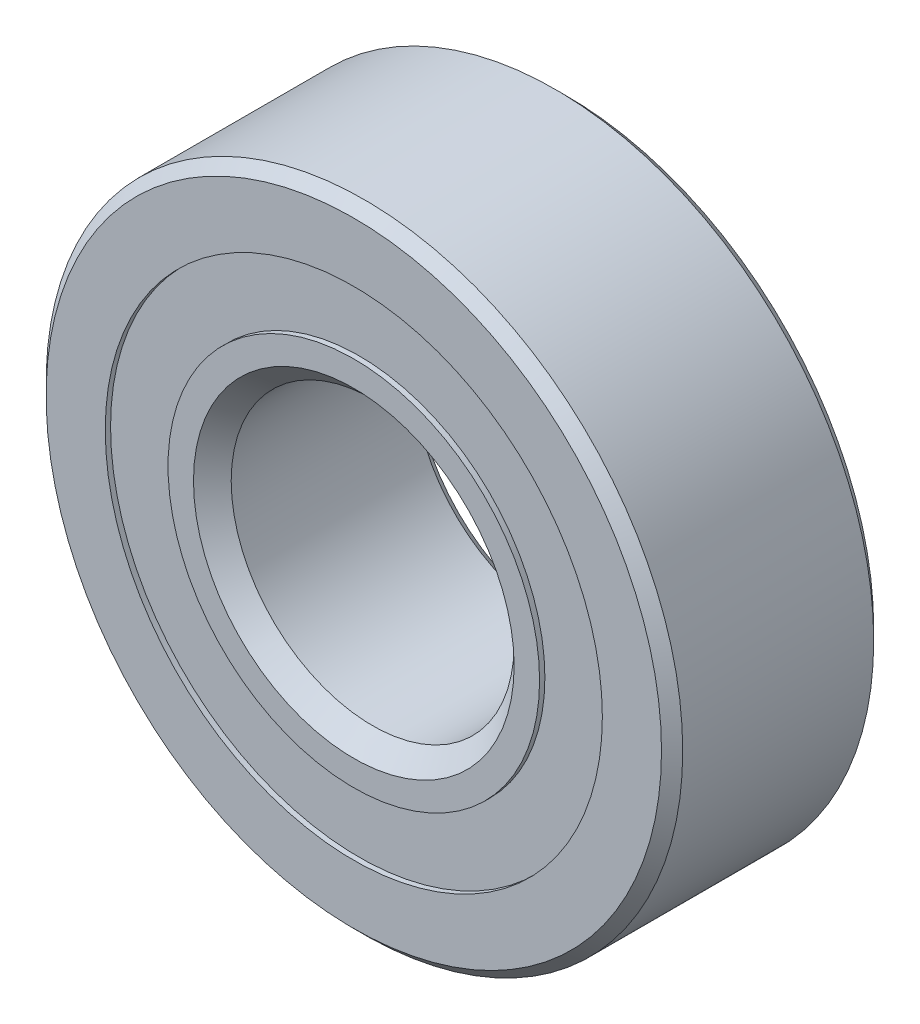
ISO-10303-21;
HEADER;
FILE_DESCRIPTION(('STEP AP214'),'2;1');
FILE_NAME('part.step','',(''),(''),'','','');
FILE_SCHEMA(('AUTOMOTIVE_DESIGN { 1 0 10303 214 1 1 1 1 }'));
ENDSEC;
DATA;
#1=APPLICATION_CONTEXT('core data for automotive mechanical design processes');
#2=APPLICATION_PROTOCOL_DEFINITION('international standard','automotive_design',2000,#1);
#3=PRODUCT_CONTEXT('',#1,'mechanical');
#4=PRODUCT('Part','Part','',(#3));
#5=PRODUCT_RELATED_PRODUCT_CATEGORY('part','',(#4));
#6=PRODUCT_DEFINITION_FORMATION('','',#4);
#7=PRODUCT_DEFINITION_CONTEXT('part definition',#1,'design');
#8=PRODUCT_DEFINITION('design','',#6,#7);
#9=PRODUCT_DEFINITION_SHAPE('','',#8);
#10=(LENGTH_UNIT() NAMED_UNIT(*) SI_UNIT(.MILLI.,.METRE.));
#11=(NAMED_UNIT(*) PLANE_ANGLE_UNIT() SI_UNIT($,.RADIAN.));
#12=(NAMED_UNIT(*) SI_UNIT($,.STERADIAN.) SOLID_ANGLE_UNIT());
#13=UNCERTAINTY_MEASURE_WITH_UNIT(LENGTH_MEASURE(1.E-05),#10,'distance_accuracy_value','');
#14=(GEOMETRIC_REPRESENTATION_CONTEXT(3) GLOBAL_UNCERTAINTY_ASSIGNED_CONTEXT((#13)) GLOBAL_UNIT_ASSIGNED_CONTEXT((#10,
#11,#12)) REPRESENTATION_CONTEXT('',''));
#15=CARTESIAN_POINT('',(0.,0.,0.));
#16=DIRECTION('',(0.,0.,1.));
#17=DIRECTION('',(1.,0.,0.));
#18=AXIS2_PLACEMENT_3D('',#15,#16,#17);
#19=CARTESIAN_POINT('',(0.,11.1561126373626,-4.524375));
#20=DIRECTION('',(0.,0.,1.));
#21=DIRECTION('',(1.,0.,0.));
#22=AXIS2_PLACEMENT_3D('',#19,#20,#21);
#23=PLANE('',#22);
#24=CARTESIAN_POINT('',(0.,0.,-4.524375));
#25=DIRECTION('',(0.,0.,1.));
#26=DIRECTION('',(1.,0.,0.));
#27=AXIS2_PLACEMENT_3D('',#24,#25,#26);
#28=CIRCLE('',#27,11.1561126373626);
#29=CARTESIAN_POINT('',(11.1561126373626,0.,-4.524375));
#30=VERTEX_POINT('',#29);
#31=EDGE_CURVE('E55',#30,#30,#28,.T.);
#32=ORIENTED_EDGE('',*,*,#31,.F.);
#33=EDGE_LOOP('',(#32));
#34=FACE_BOUND('',#33,.T.);
#35=CARTESIAN_POINT('',(0.,0.,-4.524375));
#36=DIRECTION('',(0.,0.,1.));
#37=DIRECTION('',(1.,0.,0.));
#38=AXIS2_PLACEMENT_3D('',#35,#36,#37);
#39=CIRCLE('',#38,8.33881099868363);
#40=CARTESIAN_POINT('',(8.33881099868363,0.,-4.524375));
#41=VERTEX_POINT('',#40);
#42=EDGE_CURVE('E11',#41,#41,#39,.T.);
#43=ORIENTED_EDGE('',*,*,#42,.T.);
#44=EDGE_LOOP('',(#43));
#45=FACE_BOUND('',#44,.T.);
#46=ADVANCED_FACE('F41',(#34,#45),#23,.F.);
#47=CARTESIAN_POINT('',(0.,0.,4.7625));
#48=DIRECTION('',(0.,0.,1.));
#49=DIRECTION('',(1.,0.,0.));
#50=AXIS2_PLACEMENT_3D('',#47,#48,#49);
#51=CYLINDRICAL_SURFACE('',#50,8.33881099868363);
#52=ORIENTED_EDGE('',*,*,#42,.F.);
#53=EDGE_LOOP('',(#52));
#54=FACE_BOUND('',#53,.T.);
#55=CARTESIAN_POINT('',(0.,0.,-2.27628073054021));
#56=DIRECTION('',(0.,0.,1.));
#57=DIRECTION('',(1.,0.,0.));
#58=AXIS2_PLACEMENT_3D('',#55,#56,#57);
#59=CIRCLE('',#58,8.33881099868363);
#60=CARTESIAN_POINT('',(8.33881099868363,0.,-2.27628073054021));
#61=VERTEX_POINT('',#60);
#62=EDGE_CURVE('E47',#61,#61,#59,.T.);
#63=ORIENTED_EDGE('',*,*,#62,.T.);
#64=EDGE_LOOP('',(#63));
#65=FACE_BOUND('',#64,.T.);
#66=ADVANCED_FACE('F64',(#54,#65),#51,.F.);
#67=CARTESIAN_POINT('',(0.,11.1561126373626,-2.27628073054021));
#68=DIRECTION('',(0.,0.,-1.));
#69=DIRECTION('',(-1.,0.,0.));
#70=AXIS2_PLACEMENT_3D('',#67,#68,#69);
#71=PLANE('',#70);
#72=ORIENTED_EDGE('',*,*,#62,.F.);
#73=EDGE_LOOP('',(#72));
#74=FACE_BOUND('',#73,.T.);
#75=CARTESIAN_POINT('',(0.,0.,-2.27628073054021));
#76=DIRECTION('',(0.,0.,1.));
#77=DIRECTION('',(1.,0.,0.));
#78=AXIS2_PLACEMENT_3D('',#75,#76,#77);
#79=CIRCLE('',#78,11.1561126373626);
#80=CARTESIAN_POINT('',(11.1561126373626,0.,-2.27628073054021));
#81=VERTEX_POINT('',#80);
#82=EDGE_CURVE('E51',#81,#81,#79,.T.);
#83=ORIENTED_EDGE('',*,*,#82,.T.);
#84=EDGE_LOOP('',(#83));
#85=FACE_BOUND('',#84,.T.);
#86=ADVANCED_FACE('F68',(#74,#85),#71,.F.);
#87=CARTESIAN_POINT('',(0.,0.,4.7625));
#88=DIRECTION('',(0.,0.,1.));
#89=DIRECTION('',(1.,0.,0.));
#90=AXIS2_PLACEMENT_3D('',#87,#88,#89);
#91=CYLINDRICAL_SURFACE('',#90,11.1561126373626);
#92=ORIENTED_EDGE('',*,*,#82,.F.);
#93=EDGE_LOOP('',(#92));
#94=FACE_BOUND('',#93,.T.);
#95=ORIENTED_EDGE('',*,*,#31,.T.);
#96=EDGE_LOOP('',(#95));
#97=FACE_BOUND('',#96,.T.);
#98=ADVANCED_FACE('F61',(#94,#97),#91,.T.);
#99=CLOSED_SHELL('',(#46,#66,#86,#98));
#100=MANIFOLD_SOLID_BREP('B2',#99);
#101=CARTESIAN_POINT('',(0.,11.1561126373626,4.524375));
#102=DIRECTION('',(0.,0.,-1.));
#103=DIRECTION('',(-1.,0.,0.));
#104=AXIS2_PLACEMENT_3D('',#101,#102,#103);
#105=PLANE('',#104);
#106=CARTESIAN_POINT('',(0.,0.,4.524375));
#107=DIRECTION('',(0.,0.,1.));
#108=DIRECTION('',(1.,0.,0.));
#109=AXIS2_PLACEMENT_3D('',#106,#107,#108);
#110=CIRCLE('',#109,8.33881099868363);
#111=CARTESIAN_POINT('',(8.33881099868363,0.,4.524375));
#112=VERTEX_POINT('',#111);
#113=EDGE_CURVE('E40',#112,#112,#110,.T.);
#114=ORIENTED_EDGE('',*,*,#113,.F.);
#115=EDGE_LOOP('',(#114));
#116=FACE_BOUND('',#115,.T.);
#117=CARTESIAN_POINT('',(0.,0.,4.524375));
#118=DIRECTION('',(0.,0.,1.));
#119=DIRECTION('',(1.,0.,0.));
#120=AXIS2_PLACEMENT_3D('',#117,#118,#119);
#121=CIRCLE('',#120,11.1561126373626);
#122=CARTESIAN_POINT('',(11.1561126373626,0.,4.524375));
#123=VERTEX_POINT('',#122);
#124=EDGE_CURVE('E122',#123,#123,#121,.T.);
#125=ORIENTED_EDGE('',*,*,#124,.T.);
#126=EDGE_LOOP('',(#125));
#127=FACE_BOUND('',#126,.T.);
#128=ADVANCED_FACE('F108',(#116,#127),#105,.F.);
#129=CARTESIAN_POINT('',(0.,0.,4.7625));
#130=DIRECTION('',(0.,0.,1.));
#131=DIRECTION('',(1.,0.,0.));
#132=AXIS2_PLACEMENT_3D('',#129,#130,#131);
#133=CYLINDRICAL_SURFACE('',#132,8.33881099868363);
#134=CARTESIAN_POINT('',(0.,0.,2.27628073054021));
#135=DIRECTION('',(0.,0.,1.));
#136=DIRECTION('',(1.,0.,0.));
#137=AXIS2_PLACEMENT_3D('',#134,#135,#136);
#138=CIRCLE('',#137,8.33881099868363);
#139=CARTESIAN_POINT('',(8.33881099868363,0.,2.27628073054021));
#140=VERTEX_POINT('',#139);
#141=EDGE_CURVE('E114',#140,#140,#138,.T.);
#142=ORIENTED_EDGE('',*,*,#141,.F.);
#143=EDGE_LOOP('',(#142));
#144=FACE_BOUND('',#143,.T.);
#145=ORIENTED_EDGE('',*,*,#113,.T.);
#146=EDGE_LOOP('',(#145));
#147=FACE_BOUND('',#146,.T.);
#148=ADVANCED_FACE('F137',(#144,#147),#133,.F.);
#149=CARTESIAN_POINT('',(0.,11.1561126373626,2.27628073054021));
#150=DIRECTION('',(0.,0.,1.));
#151=DIRECTION('',(1.,0.,0.));
#152=AXIS2_PLACEMENT_3D('',#149,#150,#151);
#153=PLANE('',#152);
#154=CARTESIAN_POINT('',(0.,0.,2.27628073054021));
#155=DIRECTION('',(0.,0.,1.));
#156=DIRECTION('',(1.,0.,0.));
#157=AXIS2_PLACEMENT_3D('',#154,#155,#156);
#158=CIRCLE('',#157,11.1561126373626);
#159=CARTESIAN_POINT('',(11.1561126373626,0.,2.27628073054021));
#160=VERTEX_POINT('',#159);
#161=EDGE_CURVE('E118',#160,#160,#158,.T.);
#162=ORIENTED_EDGE('',*,*,#161,.F.);
#163=EDGE_LOOP('',(#162));
#164=FACE_BOUND('',#163,.T.);
#165=ORIENTED_EDGE('',*,*,#141,.T.);
#166=EDGE_LOOP('',(#165));
#167=FACE_BOUND('',#166,.T.);
#168=ADVANCED_FACE('F132',(#164,#167),#153,.F.);
#169=CARTESIAN_POINT('',(0.,0.,4.7625));
#170=DIRECTION('',(0.,0.,1.));
#171=DIRECTION('',(1.,0.,0.));
#172=AXIS2_PLACEMENT_3D('',#169,#170,#171);
#173=CYLINDRICAL_SURFACE('',#172,11.1561126373626);
#174=ORIENTED_EDGE('',*,*,#124,.F.);
#175=EDGE_LOOP('',(#174));
#176=FACE_BOUND('',#175,.T.);
#177=ORIENTED_EDGE('',*,*,#161,.T.);
#178=EDGE_LOOP('',(#177));
#179=FACE_BOUND('',#178,.T.);
#180=ADVANCED_FACE('F129',(#176,#179),#173,.T.);
#181=CLOSED_SHELL('',(#128,#148,#168,#180));
#182=MANIFOLD_SOLID_BREP('B6',#181);
#183=CARTESIAN_POINT('',(-6.06520907209285,8.34804411070657,0.));
#184=DIRECTION('',(0.,0.,1.));
#185=DIRECTION('',(-0.587785252292462,0.809016994374955,0.));
#186=AXIS2_PLACEMENT_3D('',#183,#184,#185);
#187=SPHERICAL_SURFACE('',#186,2.27628073054021);
#188=CARTESIAN_POINT('',(-6.06520907209285,8.34804411070657,2.27628073054021));
#189=VERTEX_POINT('',#188);
#190=VERTEX_LOOP('',#189);
#191=FACE_BOUND('',#190,.T.);
#192=ADVANCED_FACE('F188',(#191),#187,.T.);
#193=CLOSED_SHELL('',(#192));
#194=MANIFOLD_SOLID_BREP('B35',#193);
#195=CARTESIAN_POINT('',(-9.81371442752058,3.1886691107066,0.));
#196=DIRECTION('',(0.,0.,1.));
#197=DIRECTION('',(-0.95105651629515,0.309016994374958,0.));
#198=AXIS2_PLACEMENT_3D('',#195,#196,#197);
#199=SPHERICAL_SURFACE('',#198,2.27628073054021);
#200=CARTESIAN_POINT('',(-9.81371442752058,3.1886691107066,2.27628073054021));
#201=VERTEX_POINT('',#200);
#202=VERTEX_LOOP('',#201);
#203=FACE_BOUND('',#202,.T.);
#204=ADVANCED_FACE('F219',(#203),#199,.T.);
#205=CLOSED_SHELL('',(#204));
#206=MANIFOLD_SOLID_BREP('B104',#205);
#207=CARTESIAN_POINT('',(-9.81371442752065,-3.18866911070639,0.));
#208=DIRECTION('',(0.,0.,1.));
#209=DIRECTION('',(-0.951056516295157,-0.309016994374938,0.));
#210=AXIS2_PLACEMENT_3D('',#207,#208,#209);
#211=SPHERICAL_SURFACE('',#210,2.27628073054021);
#212=CARTESIAN_POINT('',(-9.81371442752065,-3.18866911070639,2.27628073054021));
#213=VERTEX_POINT('',#212);
#214=VERTEX_LOOP('',#213);
#215=FACE_BOUND('',#214,.T.);
#216=ADVANCED_FACE('F250',(#215),#211,.T.);
#217=CLOSED_SHELL('',(#216));
#218=MANIFOLD_SOLID_BREP('B184',#217);
#219=CARTESIAN_POINT('',(-6.06520907209303,-8.34804411070643,0.));
#220=DIRECTION('',(0.,0.,1.));
#221=DIRECTION('',(-0.58778525229248,-0.809016994374942,0.));
#222=AXIS2_PLACEMENT_3D('',#219,#220,#221);
#223=SPHERICAL_SURFACE('',#222,2.27628073054021);
#224=CARTESIAN_POINT('',(-6.06520907209303,-8.34804411070643,2.27628073054021));
#225=VERTEX_POINT('',#224);
#226=VERTEX_LOOP('',#225);
#227=FACE_BOUND('',#226,.T.);
#228=ADVANCED_FACE('F281',(#227),#223,.T.);
#229=CLOSED_SHELL('',(#228));
#230=MANIFOLD_SOLID_BREP('B215',#229);
#231=CARTESIAN_POINT('',(0.,-10.31875,0.));
#232=DIRECTION('',(0.,0.,1.));
#233=DIRECTION('',(0.,-1.,0.));
#234=AXIS2_PLACEMENT_3D('',#231,#232,#233);
#235=SPHERICAL_SURFACE('',#234,2.27628073054021);
#236=CARTESIAN_POINT('',(0.,-10.31875,2.27628073054021));
#237=VERTEX_POINT('',#236);
#238=VERTEX_LOOP('',#237);
#239=FACE_BOUND('',#238,.T.);
#240=ADVANCED_FACE('F312',(#239),#235,.T.);
#241=CLOSED_SHELL('',(#240));
#242=MANIFOLD_SOLID_BREP('B246',#241);
#243=CARTESIAN_POINT('',(6.06520907209291,-8.34804411070652,0.));
#244=DIRECTION('',(0.,0.,1.));
#245=DIRECTION('',(0.587785252292469,-0.809016994374951,0.));
#246=AXIS2_PLACEMENT_3D('',#243,#244,#245);
#247=SPHERICAL_SURFACE('',#246,2.27628073054021);
#248=CARTESIAN_POINT('',(6.06520907209291,-8.34804411070652,2.27628073054021));
#249=VERTEX_POINT('',#248);
#250=VERTEX_LOOP('',#249);
#251=FACE_BOUND('',#250,.T.);
#252=ADVANCED_FACE('F343',(#251),#247,.T.);
#253=CLOSED_SHELL('',(#252));
#254=MANIFOLD_SOLID_BREP('B277',#253);
#255=CARTESIAN_POINT('',(9.8137144275206,-3.18866911070653,0.));
#256=DIRECTION('',(0.,0.,1.));
#257=DIRECTION('',(0.951056516295152,-0.309016994374952,0.));
#258=AXIS2_PLACEMENT_3D('',#255,#256,#257);
#259=SPHERICAL_SURFACE('',#258,2.27628073054021);
#260=CARTESIAN_POINT('',(9.8137144275206,-3.18866911070653,2.27628073054021));
#261=VERTEX_POINT('',#260);
#262=VERTEX_LOOP('',#261);
#263=FACE_BOUND('',#262,.T.);
#264=ADVANCED_FACE('F374',(#263),#259,.T.);
#265=CLOSED_SHELL('',(#264));
#266=MANIFOLD_SOLID_BREP('B308',#265);
#267=CARTESIAN_POINT('',(9.81371442752063,3.18866911070646,0.));
#268=DIRECTION('',(0.,0.,1.));
#269=DIRECTION('',(0.951056516295155,0.309016994374945,0.));
#270=AXIS2_PLACEMENT_3D('',#267,#268,#269);
#271=SPHERICAL_SURFACE('',#270,2.27628073054021);
#272=CARTESIAN_POINT('',(9.81371442752063,3.18866911070646,2.27628073054021));
#273=VERTEX_POINT('',#272);
#274=VERTEX_LOOP('',#273);
#275=FACE_BOUND('',#274,.T.);
#276=ADVANCED_FACE('F403',(#275),#271,.T.);
#277=CLOSED_SHELL('',(#276));
#278=MANIFOLD_SOLID_BREP('B339',#277);
#279=CARTESIAN_POINT('',(6.06520907209297,8.34804411070648,0.));
#280=DIRECTION('',(0.,0.,1.));
#281=DIRECTION('',(0.587785252292474,0.809016994374947,0.));
#282=AXIS2_PLACEMENT_3D('',#279,#280,#281);
#283=SPHERICAL_SURFACE('',#282,2.27628073054021);
#284=CARTESIAN_POINT('',(6.06520907209297,8.34804411070648,2.27628073054021));
#285=VERTEX_POINT('',#284);
#286=VERTEX_LOOP('',#285);
#287=FACE_BOUND('',#286,.T.);
#288=ADVANCED_FACE('F434',(#287),#283,.T.);
#289=CLOSED_SHELL('',(#288));
#290=MANIFOLD_SOLID_BREP('B370',#289);
#291=CARTESIAN_POINT('',(0.,10.31875,0.));
#292=DIRECTION('',(0.,0.,1.));
#293=DIRECTION('',(0.,1.,0.));
#294=AXIS2_PLACEMENT_3D('',#291,#292,#293);
#295=SPHERICAL_SURFACE('',#294,2.27628073054021);
#296=CARTESIAN_POINT('',(0.,10.31875,2.27628073054021));
#297=VERTEX_POINT('',#296);
#298=VERTEX_LOOP('',#297);
#299=FACE_BOUND('',#298,.T.);
#300=ADVANCED_FACE('F467',(#299),#295,.T.);
#301=CLOSED_SHELL('',(#300));
#302=MANIFOLD_SOLID_BREP('B399',#301);
#303=CARTESIAN_POINT('',(0.,0.,4.7625));
#304=DIRECTION('',(0.,0.,1.));
#305=DIRECTION('',(1.,0.,0.));
#306=AXIS2_PLACEMENT_3D('',#303,#304,#305);
#307=CYLINDRICAL_SURFACE('',#306,8.33881099868363);
#308=CARTESIAN_POINT('',(0.,0.,4.7625));
#309=DIRECTION('',(0.,0.,1.));
#310=DIRECTION('',(1.,0.,0.));
#311=AXIS2_PLACEMENT_3D('',#308,#309,#310);
#312=CIRCLE('',#311,8.33881099868363);
#313=CARTESIAN_POINT('',(8.33881099868363,0.,4.7625));
#314=VERTEX_POINT('',#313);
#315=EDGE_CURVE('E526',#314,#314,#312,.T.);
#316=ORIENTED_EDGE('',*,*,#315,.F.);
#317=EDGE_LOOP('',(#316));
#318=FACE_BOUND('',#317,.T.);
#319=CARTESIAN_POINT('',(0.,0.,4.524375));
#320=DIRECTION('',(0.,0.,1.));
#321=DIRECTION('',(1.,0.,0.));
#322=AXIS2_PLACEMENT_3D('',#319,#320,#321);
#323=CIRCLE('',#322,8.33881099868363);
#324=CARTESIAN_POINT('',(8.33881099868363,0.,4.524375));
#325=VERTEX_POINT('',#324);
#326=EDGE_CURVE('E466',#325,#325,#323,.T.);
#327=ORIENTED_EDGE('',*,*,#326,.T.);
#328=EDGE_LOOP('',(#327));
#329=FACE_BOUND('',#328,.T.);
#330=ADVANCED_FACE('F486',(#318,#329),#307,.T.);
#331=CARTESIAN_POINT('',(0.,8.33881099868363,4.524375));
#332=DIRECTION('',(0.,0.,1.));
#333=DIRECTION('',(1.,0.,0.));
#334=AXIS2_PLACEMENT_3D('',#331,#332,#333);
#335=PLANE('',#334);
#336=ORIENTED_EDGE('',*,*,#326,.F.);
#337=EDGE_LOOP('',(#336));
#338=FACE_BOUND('',#337,.T.);
#339=CARTESIAN_POINT('',(0.,0.,4.524375));
#340=DIRECTION('',(0.,0.,1.));
#341=DIRECTION('',(1.,0.,0.));
#342=AXIS2_PLACEMENT_3D('',#339,#340,#341);
#343=CIRCLE('',#342,8.10068599868363);
#344=CARTESIAN_POINT('',(8.10068599868363,0.,4.524375));
#345=VERTEX_POINT('',#344);
#346=EDGE_CURVE('E492',#345,#345,#343,.T.);
#347=ORIENTED_EDGE('',*,*,#346,.T.);
#348=EDGE_LOOP('',(#347));
#349=FACE_BOUND('',#348,.T.);
#350=ADVANCED_FACE('F533',(#338,#349),#335,.F.);
#351=CARTESIAN_POINT('',(0.,0.,3.61992363604627));
#352=DIRECTION('',(0.,0.,1.));
#353=DIRECTION('',(1.,0.,0.));
#354=AXIS2_PLACEMENT_3D('',#351,#352,#353);
#355=CONICAL_SURFACE('',#354,7.19623463472989,0.78539816339745);
#356=ORIENTED_EDGE('',*,*,#346,.F.);
#357=EDGE_LOOP('',(#356));
#358=FACE_BOUND('',#357,.T.);
#359=CARTESIAN_POINT('',(0.,0.,3.61992363604627));
#360=DIRECTION('',(0.,0.,1.));
#361=DIRECTION('',(1.,0.,0.));
#362=AXIS2_PLACEMENT_3D('',#359,#360,#361);
#363=CIRCLE('',#362,7.19623463472989);
#364=CARTESIAN_POINT('',(7.19623463472989,0.,3.61992363604627));
#365=VERTEX_POINT('',#364);
#366=EDGE_CURVE('E496',#365,#365,#363,.T.);
#367=ORIENTED_EDGE('',*,*,#366,.T.);
#368=EDGE_LOOP('',(#367));
#369=FACE_BOUND('',#368,.T.);
#370=ADVANCED_FACE('F537',(#358,#369),#355,.T.);
#371=CARTESIAN_POINT('',(0.,0.,4.7625));
#372=DIRECTION('',(0.,0.,1.));
#373=DIRECTION('',(1.,0.,0.));
#374=AXIS2_PLACEMENT_3D('',#371,#372,#373);
#375=CYLINDRICAL_SURFACE('',#374,7.19623463472989);
#376=ORIENTED_EDGE('',*,*,#366,.F.);
#377=EDGE_LOOP('',(#376));
#378=FACE_BOUND('',#377,.T.);
#379=CARTESIAN_POINT('',(0.,0.,0.));
#380=DIRECTION('',(0.,0.,1.));
#381=DIRECTION('',(1.,0.,0.));
#382=AXIS2_PLACEMENT_3D('',#379,#380,#381);
#383=CIRCLE('',#382,7.19623463472989);
#384=CARTESIAN_POINT('',(7.19623463472989,0.,0.));
#385=VERTEX_POINT('',#384);
#386=EDGE_CURVE('E500',#385,#385,#383,.T.);
#387=ORIENTED_EDGE('',*,*,#386,.T.);
#388=EDGE_LOOP('',(#387));
#389=FACE_BOUND('',#388,.T.);
#390=ADVANCED_FACE('F542',(#378,#389),#375,.T.);
#391=CARTESIAN_POINT('',(0.,7.19623463472989,0.));
#392=DIRECTION('',(0.,0.,-1.));
#393=DIRECTION('',(-1.,0.,0.));
#394=AXIS2_PLACEMENT_3D('',#391,#392,#393);
#395=PLANE('',#394);
#396=ORIENTED_EDGE('',*,*,#386,.F.);
#397=EDGE_LOOP('',(#396));
#398=FACE_BOUND('',#397,.T.);
#399=CARTESIAN_POINT('',(0.,0.,0.));
#400=DIRECTION('',(0.,0.,1.));
#401=DIRECTION('',(1.,0.,0.));
#402=AXIS2_PLACEMENT_3D('',#399,#400,#401);
#403=CIRCLE('',#402,8.04246926945979);
#404=CARTESIAN_POINT('',(8.04246926945979,0.,0.));
#405=VERTEX_POINT('',#404);
#406=EDGE_CURVE('E505',#405,#405,#403,.T.);
#407=ORIENTED_EDGE('',*,*,#406,.T.);
#408=EDGE_LOOP('',(#407));
#409=FACE_BOUND('',#408,.T.);
#410=ADVANCED_FACE('F548',(#398,#409),#395,.F.);
#411=CARTESIAN_POINT('',(0.,0.,0.));
#412=DIRECTION('',(0.,0.,1.));
#413=DIRECTION('',(1.,0.,0.));
#414=AXIS2_PLACEMENT_3D('',#411,#412,#413);
#415=TOROIDAL_SURFACE('',#414,10.31875,2.27628073054021);
#416=ORIENTED_EDGE('',*,*,#406,.F.);
#417=EDGE_LOOP('',(#416));
#418=FACE_BOUND('',#417,.T.);
#419=CARTESIAN_POINT('',(0.,0.,-2.11666666666666));
#420=DIRECTION('',(0.,0.,1.));
#421=DIRECTION('',(1.,0.,0.));
#422=AXIS2_PLACEMENT_3D('',#419,#420,#421);
#423=CIRCLE('',#422,9.48138736263736);
#424=CARTESIAN_POINT('',(9.48138736263736,0.,-2.11666666666666));
#425=VERTEX_POINT('',#424);
#426=EDGE_CURVE('E508',#425,#425,#423,.T.);
#427=ORIENTED_EDGE('',*,*,#426,.T.);
#428=EDGE_LOOP('',(#427));
#429=FACE_BOUND('',#428,.T.);
#430=ADVANCED_FACE('F552',(#418,#429),#415,.F.);
#431=CARTESIAN_POINT('',(0.,0.,4.7625));
#432=DIRECTION('',(0.,0.,1.));
#433=DIRECTION('',(1.,0.,0.));
#434=AXIS2_PLACEMENT_3D('',#431,#432,#433);
#435=CYLINDRICAL_SURFACE('',#434,9.48138736263736);
#436=ORIENTED_EDGE('',*,*,#426,.F.);
#437=EDGE_LOOP('',(#436));
#438=FACE_BOUND('',#437,.T.);
#439=CARTESIAN_POINT('',(0.,0.,-4.7625));
#440=DIRECTION('',(0.,0.,1.));
#441=DIRECTION('',(1.,0.,0.));
#442=AXIS2_PLACEMENT_3D('',#439,#440,#441);
#443=CIRCLE('',#442,9.48138736263736);
#444=CARTESIAN_POINT('',(9.48138736263736,0.,-4.7625));
#445=VERTEX_POINT('',#444);
#446=EDGE_CURVE('E511',#445,#445,#443,.T.);
#447=ORIENTED_EDGE('',*,*,#446,.T.);
#448=EDGE_LOOP('',(#447));
#449=FACE_BOUND('',#448,.T.);
#450=ADVANCED_FACE('F556',(#438,#449),#435,.T.);
#451=CARTESIAN_POINT('',(0.,6.82624999999999,-4.7625));
#452=DIRECTION('',(0.,0.,1.));
#453=DIRECTION('',(1.,0.,0.));
#454=AXIS2_PLACEMENT_3D('',#451,#452,#453);
#455=PLANE('',#454);
#456=ORIENTED_EDGE('',*,*,#446,.F.);
#457=EDGE_LOOP('',(#456));
#458=FACE_BOUND('',#457,.T.);
#459=CARTESIAN_POINT('',(0.,0.,-4.7625));
#460=DIRECTION('',(0.,0.,1.));
#461=DIRECTION('',(1.,0.,0.));
#462=AXIS2_PLACEMENT_3D('',#459,#460,#461);
#463=CIRCLE('',#462,6.82624999999999);
#464=CARTESIAN_POINT('',(6.82624999999999,0.,-4.7625));
#465=VERTEX_POINT('',#464);
#466=EDGE_CURVE('E514',#465,#465,#463,.T.);
#467=ORIENTED_EDGE('',*,*,#466,.T.);
#468=EDGE_LOOP('',(#467));
#469=FACE_BOUND('',#468,.T.);
#470=ADVANCED_FACE('F560',(#458,#469),#455,.F.);
#471=CARTESIAN_POINT('',(0.,0.,-4.28625));
#472=DIRECTION('',(0.,0.,-1.));
#473=DIRECTION('',(-1.,0.,0.));
#474=AXIS2_PLACEMENT_3D('',#471,#472,#473);
#475=CONICAL_SURFACE('',#474,6.35,0.785398163397445);
#476=ORIENTED_EDGE('',*,*,#466,.F.);
#477=EDGE_LOOP('',(#476));
#478=FACE_BOUND('',#477,.T.);
#479=CARTESIAN_POINT('',(0.,0.,-4.28625));
#480=DIRECTION('',(0.,0.,1.));
#481=DIRECTION('',(1.,0.,0.));
#482=AXIS2_PLACEMENT_3D('',#479,#480,#481);
#483=CIRCLE('',#482,6.35);
#484=CARTESIAN_POINT('',(6.35,0.,-4.28625));
#485=VERTEX_POINT('',#484);
#486=EDGE_CURVE('E517',#485,#485,#483,.T.);
#487=ORIENTED_EDGE('',*,*,#486,.T.);
#488=EDGE_LOOP('',(#487));
#489=FACE_BOUND('',#488,.T.);
#490=ADVANCED_FACE('F564',(#478,#489),#475,.F.);
#491=CARTESIAN_POINT('',(0.,0.,4.7625));
#492=DIRECTION('',(0.,0.,1.));
#493=DIRECTION('',(1.,0.,0.));
#494=AXIS2_PLACEMENT_3D('',#491,#492,#493);
#495=CYLINDRICAL_SURFACE('',#494,6.35);
#496=ORIENTED_EDGE('',*,*,#486,.F.);
#497=EDGE_LOOP('',(#496));
#498=FACE_BOUND('',#497,.T.);
#499=CARTESIAN_POINT('',(0.,0.,3.91626536527011));
#500=DIRECTION('',(0.,0.,1.));
#501=DIRECTION('',(1.,0.,0.));
#502=AXIS2_PLACEMENT_3D('',#499,#500,#501);
#503=CIRCLE('',#502,6.35);
#504=CARTESIAN_POINT('',(6.35,0.,3.91626536527011));
#505=VERTEX_POINT('',#504);
#506=EDGE_CURVE('E520',#505,#505,#503,.T.);
#507=ORIENTED_EDGE('',*,*,#506,.T.);
#508=EDGE_LOOP('',(#507));
#509=FACE_BOUND('',#508,.T.);
#510=ADVANCED_FACE('F568',(#498,#509),#495,.F.);
#511=CARTESIAN_POINT('',(0.,0.,4.7625));
#512=DIRECTION('',(0.,0.,1.));
#513=DIRECTION('',(1.,0.,0.));
#514=AXIS2_PLACEMENT_3D('',#511,#512,#513);
#515=CONICAL_SURFACE('',#514,7.19623463472989,0.785398163397449);
#516=ORIENTED_EDGE('',*,*,#506,.F.);
#517=EDGE_LOOP('',(#516));
#518=FACE_BOUND('',#517,.T.);
#519=CARTESIAN_POINT('',(0.,0.,4.7625));
#520=DIRECTION('',(0.,0.,1.));
#521=DIRECTION('',(1.,0.,0.));
#522=AXIS2_PLACEMENT_3D('',#519,#520,#521);
#523=CIRCLE('',#522,7.19623463472989);
#524=CARTESIAN_POINT('',(7.19623463472989,0.,4.7625));
#525=VERTEX_POINT('',#524);
#526=EDGE_CURVE('E523',#525,#525,#523,.T.);
#527=ORIENTED_EDGE('',*,*,#526,.T.);
#528=EDGE_LOOP('',(#527));
#529=FACE_BOUND('',#528,.T.);
#530=ADVANCED_FACE('F572',(#518,#529),#515,.F.);
#531=CARTESIAN_POINT('',(0.,8.33881099868363,4.7625));
#532=DIRECTION('',(0.,0.,-1.));
#533=DIRECTION('',(-1.,0.,0.));
#534=AXIS2_PLACEMENT_3D('',#531,#532,#533);
#535=PLANE('',#534);
#536=ORIENTED_EDGE('',*,*,#526,.F.);
#537=EDGE_LOOP('',(#536));
#538=FACE_BOUND('',#537,.T.);
#539=ORIENTED_EDGE('',*,*,#315,.T.);
#540=EDGE_LOOP('',(#539));
#541=FACE_BOUND('',#540,.T.);
#542=ADVANCED_FACE('F530',(#538,#541),#535,.F.);
#543=CLOSED_SHELL('',(#330,#350,#370,#390,#410,#430,#450,#470,#490,#510,#530,#542));
#544=MANIFOLD_SOLID_BREP('B430',#543);
#545=CARTESIAN_POINT('',(0.,0.,4.28625));
#546=DIRECTION('',(0.,0.,-1.));
#547=DIRECTION('',(-1.,0.,0.));
#548=AXIS2_PLACEMENT_3D('',#545,#546,#547);
#549=CONICAL_SURFACE('',#548,14.2875,0.785398163397443);
#550=CARTESIAN_POINT('',(0.,0.,4.7625));
#551=DIRECTION('',(0.,0.,1.));
#552=DIRECTION('',(1.,0.,0.));
#553=AXIS2_PLACEMENT_3D('',#550,#551,#552);
#554=CIRCLE('',#553,13.81125);
#555=CARTESIAN_POINT('',(13.81125,0.,4.7625));
#556=VERTEX_POINT('',#555);
#557=EDGE_CURVE('E695',#556,#556,#554,.T.);
#558=ORIENTED_EDGE('',*,*,#557,.F.);
#559=EDGE_LOOP('',(#558));
#560=FACE_BOUND('',#559,.T.);
#561=CARTESIAN_POINT('',(0.,0.,4.28625));
#562=DIRECTION('',(0.,0.,1.));
#563=DIRECTION('',(1.,0.,0.));
#564=AXIS2_PLACEMENT_3D('',#561,#562,#563);
#565=CIRCLE('',#564,14.2875);
#566=CARTESIAN_POINT('',(14.2875,0.,4.28625));
#567=VERTEX_POINT('',#566);
#568=EDGE_CURVE('E485',#567,#567,#565,.T.);
#569=ORIENTED_EDGE('',*,*,#568,.T.);
#570=EDGE_LOOP('',(#569));
#571=FACE_BOUND('',#570,.T.);
#572=ADVANCED_FACE('F667',(#560,#571),#549,.T.);
#573=CARTESIAN_POINT('',(0.,0.,4.7625));
#574=DIRECTION('',(0.,0.,1.));
#575=DIRECTION('',(1.,0.,0.));
#576=AXIS2_PLACEMENT_3D('',#573,#574,#575);
#577=CYLINDRICAL_SURFACE('',#576,14.2875);
#578=ORIENTED_EDGE('',*,*,#568,.F.);
#579=EDGE_LOOP('',(#578));
#580=FACE_BOUND('',#579,.T.);
#581=CARTESIAN_POINT('',(0.,0.,-4.28625));
#582=DIRECTION('',(0.,0.,1.));
#583=DIRECTION('',(1.,0.,0.));
#584=AXIS2_PLACEMENT_3D('',#581,#582,#583);
#585=CIRCLE('',#584,14.2875);
#586=CARTESIAN_POINT('',(14.2875,0.,-4.28625));
#587=VERTEX_POINT('',#586);
#588=EDGE_CURVE('E673',#587,#587,#585,.T.);
#589=ORIENTED_EDGE('',*,*,#588,.T.);
#590=EDGE_LOOP('',(#589));
#591=FACE_BOUND('',#590,.T.);
#592=ADVANCED_FACE('F702',(#580,#591),#577,.T.);
#593=CARTESIAN_POINT('',(0.,0.,-4.7625));
#594=DIRECTION('',(0.,0.,1.));
#595=DIRECTION('',(1.,0.,0.));
#596=AXIS2_PLACEMENT_3D('',#593,#594,#595);
#597=CONICAL_SURFACE('',#596,13.81125,0.785398163397445);
#598=ORIENTED_EDGE('',*,*,#588,.F.);
#599=EDGE_LOOP('',(#598));
#600=FACE_BOUND('',#599,.T.);
#601=CARTESIAN_POINT('',(0.,0.,-4.7625));
#602=DIRECTION('',(0.,0.,1.));
#603=DIRECTION('',(1.,0.,0.));
#604=AXIS2_PLACEMENT_3D('',#601,#602,#603);
#605=CIRCLE('',#604,13.81125);
#606=CARTESIAN_POINT('',(13.81125,0.,-4.7625));
#607=VERTEX_POINT('',#606);
#608=EDGE_CURVE('E677',#607,#607,#605,.T.);
#609=ORIENTED_EDGE('',*,*,#608,.T.);
#610=EDGE_LOOP('',(#609));
#611=FACE_BOUND('',#610,.T.);
#612=ADVANCED_FACE('F706',(#600,#611),#597,.T.);
#613=CARTESIAN_POINT('',(0.,13.81125,-4.7625));
#614=DIRECTION('',(0.,0.,1.));
#615=DIRECTION('',(1.,0.,0.));
#616=AXIS2_PLACEMENT_3D('',#613,#614,#615);
#617=PLANE('',#616);
#618=ORIENTED_EDGE('',*,*,#608,.F.);
#619=EDGE_LOOP('',(#618));
#620=FACE_BOUND('',#619,.T.);
#621=CARTESIAN_POINT('',(0.,0.,-4.76250000000001));
#622=DIRECTION('',(0.,0.,1.));
#623=DIRECTION('',(1.,0.,0.));
#624=AXIS2_PLACEMENT_3D('',#621,#622,#623);
#625=CIRCLE('',#624,11.1561126373626);
#626=CARTESIAN_POINT('',(11.1561126373626,0.,-4.76250000000001));
#627=VERTEX_POINT('',#626);
#628=EDGE_CURVE('E681',#627,#627,#625,.T.);
#629=ORIENTED_EDGE('',*,*,#628,.T.);
#630=EDGE_LOOP('',(#629));
#631=FACE_BOUND('',#630,.T.);
#632=ADVANCED_FACE('F711',(#620,#631),#617,.F.);
#633=CARTESIAN_POINT('',(0.,0.,4.7625));
#634=DIRECTION('',(0.,0.,1.));
#635=DIRECTION('',(1.,0.,0.));
#636=AXIS2_PLACEMENT_3D('',#633,#634,#635);
#637=CYLINDRICAL_SURFACE('',#636,11.1561126373626);
#638=ORIENTED_EDGE('',*,*,#628,.F.);
#639=EDGE_LOOP('',(#638));
#640=FACE_BOUND('',#639,.T.);
#641=CARTESIAN_POINT('',(0.,0.,-2.11666666666667));
#642=DIRECTION('',(0.,0.,1.));
#643=DIRECTION('',(1.,0.,0.));
#644=AXIS2_PLACEMENT_3D('',#641,#642,#643);
#645=CIRCLE('',#644,11.1561126373626);
#646=CARTESIAN_POINT('',(11.1561126373626,0.,-2.11666666666667));
#647=VERTEX_POINT('',#646);
#648=EDGE_CURVE('E686',#647,#647,#645,.T.);
#649=ORIENTED_EDGE('',*,*,#648,.T.);
#650=EDGE_LOOP('',(#649));
#651=FACE_BOUND('',#650,.T.);
#652=ADVANCED_FACE('F717',(#640,#651),#637,.F.);
#653=CARTESIAN_POINT('',(0.,0.,0.));
#654=DIRECTION('',(0.,0.,1.));
#655=DIRECTION('',(1.,0.,0.));
#656=AXIS2_PLACEMENT_3D('',#653,#654,#655);
#657=TOROIDAL_SURFACE('',#656,10.31875,2.27628073054021);
#658=ORIENTED_EDGE('',*,*,#648,.F.);
#659=EDGE_LOOP('',(#658));
#660=FACE_BOUND('',#659,.T.);
#661=CARTESIAN_POINT('',(0.,0.,2.11666666666667));
#662=DIRECTION('',(0.,0.,1.));
#663=DIRECTION('',(1.,0.,0.));
#664=AXIS2_PLACEMENT_3D('',#661,#662,#663);
#665=CIRCLE('',#664,11.1561126373626);
#666=CARTESIAN_POINT('',(11.1561126373626,0.,2.11666666666667));
#667=VERTEX_POINT('',#666);
#668=EDGE_CURVE('E689',#667,#667,#665,.T.);
#669=ORIENTED_EDGE('',*,*,#668,.T.);
#670=EDGE_LOOP('',(#669));
#671=FACE_BOUND('',#670,.T.);
#672=ADVANCED_FACE('F721',(#660,#671),#657,.F.);
#673=CARTESIAN_POINT('',(0.,0.,4.7625));
#674=DIRECTION('',(0.,0.,1.));
#675=DIRECTION('',(1.,0.,0.));
#676=AXIS2_PLACEMENT_3D('',#673,#674,#675);
#677=CYLINDRICAL_SURFACE('',#676,11.1561126373626);
#678=ORIENTED_EDGE('',*,*,#668,.F.);
#679=EDGE_LOOP('',(#678));
#680=FACE_BOUND('',#679,.T.);
#681=CARTESIAN_POINT('',(0.,0.,4.7625));
#682=DIRECTION('',(0.,0.,1.));
#683=DIRECTION('',(1.,0.,0.));
#684=AXIS2_PLACEMENT_3D('',#681,#682,#683);
#685=CIRCLE('',#684,11.1561126373626);
#686=CARTESIAN_POINT('',(11.1561126373626,0.,4.7625));
#687=VERTEX_POINT('',#686);
#688=EDGE_CURVE('E692',#687,#687,#685,.T.);
#689=ORIENTED_EDGE('',*,*,#688,.T.);
#690=EDGE_LOOP('',(#689));
#691=FACE_BOUND('',#690,.T.);
#692=ADVANCED_FACE('F725',(#680,#691),#677,.F.);
#693=CARTESIAN_POINT('',(0.,13.81125,4.7625));
#694=DIRECTION('',(0.,0.,-1.));
#695=DIRECTION('',(-1.,0.,0.));
#696=AXIS2_PLACEMENT_3D('',#693,#694,#695);
#697=PLANE('',#696);
#698=ORIENTED_EDGE('',*,*,#688,.F.);
#699=EDGE_LOOP('',(#698));
#700=FACE_BOUND('',#699,.T.);
#701=ORIENTED_EDGE('',*,*,#557,.T.);
#702=EDGE_LOOP('',(#701));
#703=FACE_BOUND('',#702,.T.);
#704=ADVANCED_FACE('F699',(#700,#703),#697,.F.);
#705=CLOSED_SHELL('',(#572,#592,#612,#632,#652,#672,#692,#704));
#706=MANIFOLD_SOLID_BREP('B461',#705);
#707=ADVANCED_BREP_SHAPE_REPRESENTATION('',(#18,#100,#182,#194,#206,#218,#230,#242,#254,#266,
#278,#290,#302,#544,#706),#14);
#708=SHAPE_DEFINITION_REPRESENTATION(#9,#707);
ENDSEC;
END-ISO-10303-21;
